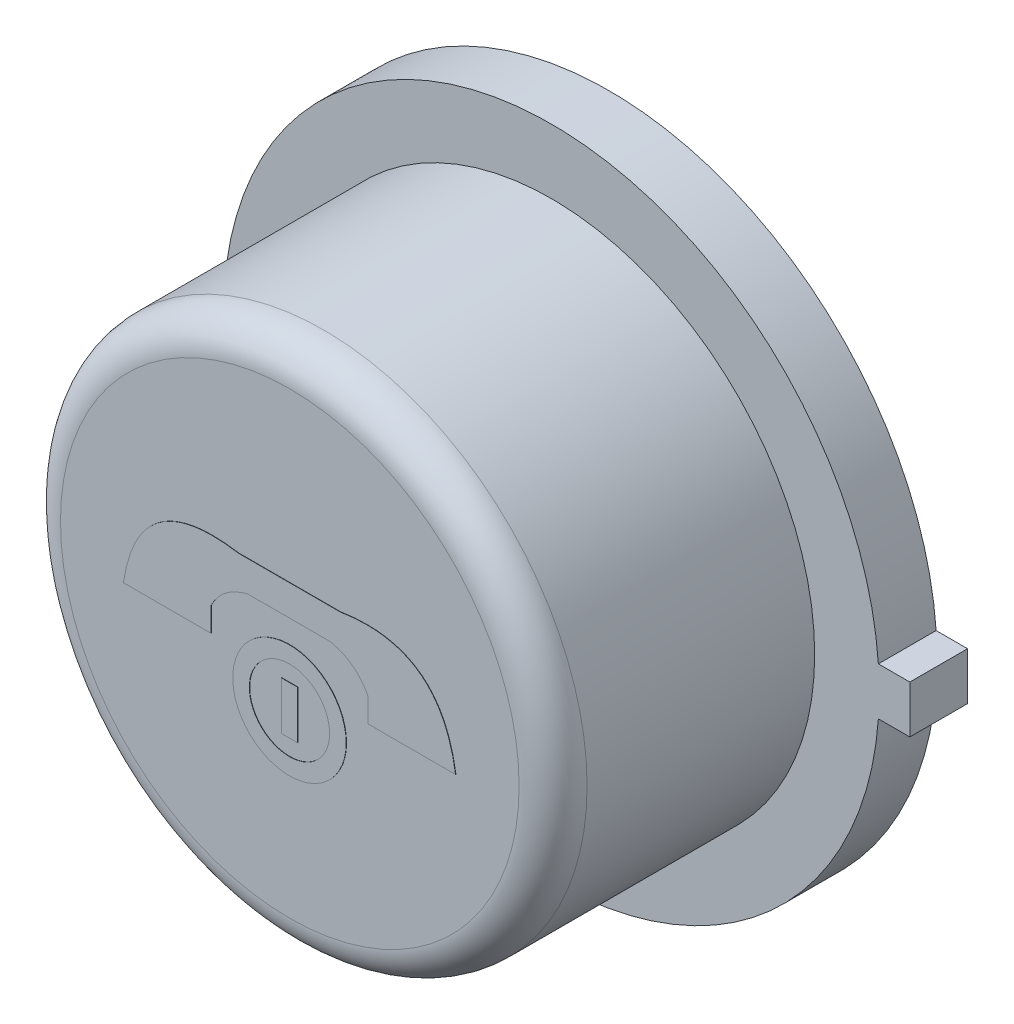
ISO-10303-21;
HEADER;
FILE_DESCRIPTION(('STEP AP214'),'2;1');
FILE_NAME('part.step','',(''),(''),'','','');
FILE_SCHEMA(('AUTOMOTIVE_DESIGN { 1 0 10303 214 1 1 1 1 }'));
ENDSEC;
DATA;
#1=APPLICATION_CONTEXT('core data for automotive mechanical design processes');
#2=APPLICATION_PROTOCOL_DEFINITION('international standard','automotive_design',2000,#1);
#3=PRODUCT_CONTEXT('',#1,'mechanical');
#4=PRODUCT('Part','Part','',(#3));
#5=PRODUCT_RELATED_PRODUCT_CATEGORY('part','',(#4));
#6=PRODUCT_DEFINITION_FORMATION('','',#4);
#7=PRODUCT_DEFINITION_CONTEXT('part definition',#1,'design');
#8=PRODUCT_DEFINITION('design','',#6,#7);
#9=PRODUCT_DEFINITION_SHAPE('','',#8);
#10=(LENGTH_UNIT() NAMED_UNIT(*) SI_UNIT(.MILLI.,.METRE.));
#11=(NAMED_UNIT(*) PLANE_ANGLE_UNIT() SI_UNIT($,.RADIAN.));
#12=(NAMED_UNIT(*) SI_UNIT($,.STERADIAN.) SOLID_ANGLE_UNIT());
#13=UNCERTAINTY_MEASURE_WITH_UNIT(LENGTH_MEASURE(1.E-05),#10,'distance_accuracy_value','');
#14=(GEOMETRIC_REPRESENTATION_CONTEXT(3) GLOBAL_UNCERTAINTY_ASSIGNED_CONTEXT((#13)) GLOBAL_UNIT_ASSIGNED_CONTEXT((#10,
#11,#12)) REPRESENTATION_CONTEXT('',''));
#15=CARTESIAN_POINT('',(0.,0.,0.));
#16=DIRECTION('',(0.,0.,1.));
#17=DIRECTION('',(1.,0.,0.));
#18=AXIS2_PLACEMENT_3D('',#15,#16,#17);
#19=CARTESIAN_POINT('',(0.,0.,2.3876));
#20=DIRECTION('',(0.,0.,1.));
#21=DIRECTION('',(1.,0.,0.));
#22=AXIS2_PLACEMENT_3D('',#19,#20,#21);
#23=PLANE('',#22);
#24=CARTESIAN_POINT('',(0.586204822214339,0.0210519107698976,2.3876));
#25=CARTESIAN_POINT('',(0.500696389227425,0.187631337955704,2.3876));
#26=CARTESIAN_POINT('',(0.309059488402211,0.231300095041167,2.3876));
#27=B_SPLINE_CURVE_WITH_KNOTS('',2,(#24,#25,#26),.UNSPECIFIED.,.F.,.F.,(3,3),(0.,1.),.UNSPECIFIED.);
#28=CARTESIAN_POINT('',(0.586204822214338,0.0210519107698981,2.3876));
#29=VERTEX_POINT('',#28);
#30=CARTESIAN_POINT('',(0.309059488402211,0.231300095041167,2.3876));
#31=VERTEX_POINT('',#30);
#32=EDGE_CURVE('E237',#29,#31,#27,.T.);
#33=ORIENTED_EDGE('',*,*,#32,.T.);
#34=DIRECTION('',(1.,0.,0.));
#35=VECTOR('',#34,1.);
#36=CARTESIAN_POINT('',(0.,0.231300095041167,2.3876));
#37=LINE('',#36,#35);
#38=CARTESIAN_POINT('',(-0.309059488402211,0.231300095041167,2.3876));
#39=VERTEX_POINT('',#38);
#40=EDGE_CURVE('E253',#39,#31,#37,.T.);
#41=ORIENTED_EDGE('',*,*,#40,.F.);
#42=CARTESIAN_POINT('',(-0.586204822214338,0.0210519107698975,2.3876));
#43=CARTESIAN_POINT('',(-0.500696389227425,0.187631337955704,2.3876));
#44=CARTESIAN_POINT('',(-0.309059488402211,0.231300095041167,2.3876));
#45=B_SPLINE_CURVE_WITH_KNOTS('',2,(#42,#43,#44),.UNSPECIFIED.,.F.,.F.,(3,3),(0.,1.),.UNSPECIFIED.);
#46=CARTESIAN_POINT('',(-0.586204822214338,0.0210519107698981,2.3876));
#47=VERTEX_POINT('',#46);
#48=EDGE_CURVE('E699',#47,#39,#45,.T.);
#49=ORIENTED_EDGE('',*,*,#48,.F.);
#50=DIRECTION('',(0.,1.,0.));
#51=VECTOR('',#50,1.);
#52=CARTESIAN_POINT('',(-0.586204822214338,-3.91332135623731,2.3876));
#53=LINE('',#52,#51);
#54=CARTESIAN_POINT('',(-0.586204822214338,-0.16052606655529,2.3876));
#55=VERTEX_POINT('',#54);
#56=EDGE_CURVE('E697',#55,#47,#53,.T.);
#57=ORIENTED_EDGE('',*,*,#56,.F.);
#58=DIRECTION('',(1.,0.,0.));
#59=VECTOR('',#58,1.);
#60=CARTESIAN_POINT('',(0.,-0.16052606655529,2.3876));
#61=LINE('',#60,#59);
#62=CARTESIAN_POINT('',(-1.24197144402187,-0.16052606655529,2.3876));
#63=VERTEX_POINT('',#62);
#64=EDGE_CURVE('E692',#63,#55,#61,.T.);
#65=ORIENTED_EDGE('',*,*,#64,.F.);
#66=CARTESIAN_POINT('',(-1.24197144402187,-0.16052606655529,2.3876));
#67=CARTESIAN_POINT('',(-1.13099050288792,0.580439960633998,2.3876));
#68=CARTESIAN_POINT('',(-0.37957161908372,0.460661750609824,2.3876));
#69=B_SPLINE_CURVE_WITH_KNOTS('',2,(#66,#67,#68),.UNSPECIFIED.,.F.,.F.,(3,3),(0.,1.),.UNSPECIFIED.);
#70=CARTESIAN_POINT('',(-0.37957161908372,0.460661750609825,2.3876));
#71=VERTEX_POINT('',#70);
#72=EDGE_CURVE('E687',#63,#71,#69,.T.);
#73=ORIENTED_EDGE('',*,*,#72,.T.);
#74=DIRECTION('',(1.,0.,0.));
#75=VECTOR('',#74,1.);
#76=CARTESIAN_POINT('',(0.,0.460661750609825,2.3876));
#77=LINE('',#76,#75);
#78=CARTESIAN_POINT('',(0.37957161908372,0.460661750609825,2.3876));
#79=VERTEX_POINT('',#78);
#80=EDGE_CURVE('E681',#71,#79,#77,.T.);
#81=ORIENTED_EDGE('',*,*,#80,.T.);
#82=CARTESIAN_POINT('',(1.24197144402187,-0.16052606655529,2.3876));
#83=CARTESIAN_POINT('',(1.13099050288792,0.580439960633998,2.3876));
#84=CARTESIAN_POINT('',(0.379571619083721,0.460661750609824,2.3876));
#85=B_SPLINE_CURVE_WITH_KNOTS('',2,(#82,#83,#84),.UNSPECIFIED.,.F.,.F.,(3,3),(0.,1.),.UNSPECIFIED.);
#86=CARTESIAN_POINT('',(1.24197144402187,-0.16052606655529,2.3876));
#87=VERTEX_POINT('',#86);
#88=EDGE_CURVE('E676',#87,#79,#85,.T.);
#89=ORIENTED_EDGE('',*,*,#88,.F.);
#90=DIRECTION('',(-1.,0.,0.));
#91=VECTOR('',#90,1.);
#92=CARTESIAN_POINT('',(0.,-0.16052606655529,2.3876));
#93=LINE('',#92,#91);
#94=CARTESIAN_POINT('',(0.586204822214338,-0.16052606655529,2.3876));
#95=VERTEX_POINT('',#94);
#96=EDGE_CURVE('E673',#87,#95,#93,.T.);
#97=ORIENTED_EDGE('',*,*,#96,.T.);
#98=DIRECTION('',(0.,1.,0.));
#99=VECTOR('',#98,1.);
#100=CARTESIAN_POINT('',(0.586204822214338,-3.91332135623731,2.3876));
#101=LINE('',#100,#99);
#102=EDGE_CURVE('E668',#95,#29,#101,.T.);
#103=ORIENTED_EDGE('',*,*,#102,.T.);
#104=EDGE_LOOP('',(#33,#41,#49,#57,#65,#73,#81,#89,#97,#103));
#105=FACE_BOUND('',#104,.T.);
#106=CARTESIAN_POINT('',(0.,0.,2.3876));
#107=DIRECTION('',(0.,0.,1.));
#108=DIRECTION('',(1.,0.,0.));
#109=AXIS2_PLACEMENT_3D('',#106,#107,#108);
#110=CIRCLE('',#109,1.7145);
#111=CARTESIAN_POINT('',(1.7145,0.,2.3876));
#112=VERTEX_POINT('',#111);
#113=EDGE_CURVE('E370',#112,#112,#110,.T.);
#114=ORIENTED_EDGE('',*,*,#113,.T.);
#115=EDGE_LOOP('',(#114));
#116=FACE_BOUND('',#115,.T.);
#117=CARTESIAN_POINT('',(0.,-0.366036864527016,2.3876));
#118=DIRECTION('',(0.,0.,1.));
#119=DIRECTION('',(1.,0.,0.));
#120=AXIS2_PLACEMENT_3D('',#117,#118,#119);
#121=CIRCLE('',#120,0.424306482423607);
#122=CARTESIAN_POINT('',(0.424306482423607,-0.366036864527016,2.3876));
#123=VERTEX_POINT('',#122);
#124=EDGE_CURVE('E373',#123,#123,#121,.T.);
#125=ORIENTED_EDGE('',*,*,#124,.F.);
#126=EDGE_LOOP('',(#125));
#127=FACE_BOUND('',#126,.T.);
#128=ADVANCED_FACE('F103',(#105,#116,#127),#23,.T.);
#129=CARTESIAN_POINT('',(-0.00322860507148085,-5.53029106093277,0.));
#130=DIRECTION('',(0.,0.,1.));
#131=DIRECTION('',(1.,0.,0.));
#132=AXIS2_PLACEMENT_3D('',#129,#130,#131);
#133=PLANE('',#132);
#134=DIRECTION('',(1.,0.,0.));
#135=VECTOR('',#134,1.);
#136=CARTESIAN_POINT('',(-0.0032286050714822,0.177799999999999,0.));
#137=LINE('',#136,#135);
#138=CARTESIAN_POINT('',(2.44464278985704,0.177799999999999,0.));
#139=VERTEX_POINT('',#138);
#140=CARTESIAN_POINT('',(2.6797,0.177799999999999,0.));
#141=VERTEX_POINT('',#140);
#142=EDGE_CURVE('E391',#139,#141,#137,.T.);
#143=ORIENTED_EDGE('',*,*,#142,.T.);
#144=DIRECTION('',(0.,-1.,0.));
#145=VECTOR('',#144,1.);
#146=CARTESIAN_POINT('',(2.6797,-5.53029106093277,0.));
#147=LINE('',#146,#145);
#148=CARTESIAN_POINT('',(2.6797,-0.1778,0.));
#149=VERTEX_POINT('',#148);
#150=EDGE_CURVE('E396',#141,#149,#147,.T.);
#151=ORIENTED_EDGE('',*,*,#150,.T.);
#152=DIRECTION('',(-1.,0.,0.));
#153=VECTOR('',#152,1.);
#154=CARTESIAN_POINT('',(-0.00322860507148085,-0.1778,0.));
#155=LINE('',#154,#153);
#156=CARTESIAN_POINT('',(2.44464278985704,-0.1778,0.));
#157=VERTEX_POINT('',#156);
#158=EDGE_CURVE('E410',#149,#157,#155,.T.);
#159=ORIENTED_EDGE('',*,*,#158,.T.);
#160=CARTESIAN_POINT('',(0.,0.,0.));
#161=DIRECTION('',(0.,0.,1.));
#162=DIRECTION('',(1.,0.,0.));
#163=AXIS2_PLACEMENT_3D('',#160,#161,#162);
#164=CIRCLE('',#163,2.4511);
#165=EDGE_CURVE('E407',#139,#157,#164,.T.);
#166=ORIENTED_EDGE('',*,*,#165,.F.);
#167=EDGE_LOOP('',(#143,#151,#159,#166));
#168=FACE_BOUND('',#167,.T.);
#169=CARTESIAN_POINT('',(0.,0.,0.));
#170=DIRECTION('',(0.,0.,1.));
#171=DIRECTION('',(1.,0.,0.));
#172=AXIS2_PLACEMENT_3D('',#169,#170,#171);
#173=CIRCLE('',#172,1.75756648099992);
#174=CARTESIAN_POINT('',(1.75756648099992,0.,0.));
#175=VERTEX_POINT('',#174);
#176=EDGE_CURVE('E422',#175,#175,#173,.F.);
#177=ORIENTED_EDGE('',*,*,#176,.F.);
#178=EDGE_LOOP('',(#177));
#179=FACE_BOUND('',#178,.T.);
#180=ADVANCED_FACE('F341',(#168,#179),#133,.F.);
#181=CARTESIAN_POINT('',(-0.00322860507148085,-5.53029106093277,0.4318));
#182=DIRECTION('',(0.,0.,1.));
#183=DIRECTION('',(1.,0.,0.));
#184=AXIS2_PLACEMENT_3D('',#181,#182,#183);
#185=PLANE('',#184);
#186=DIRECTION('',(1.,0.,0.));
#187=VECTOR('',#186,1.);
#188=CARTESIAN_POINT('',(-0.0032286050714822,0.177799999999999,0.4318));
#189=LINE('',#188,#187);
#190=CARTESIAN_POINT('',(2.44464278985704,0.177799999999999,0.4318));
#191=VERTEX_POINT('',#190);
#192=CARTESIAN_POINT('',(2.6797,0.177799999999999,0.4318));
#193=VERTEX_POINT('',#192);
#194=EDGE_CURVE('E392',#191,#193,#189,.T.);
#195=ORIENTED_EDGE('',*,*,#194,.F.);
#196=CARTESIAN_POINT('',(0.,0.,0.4318));
#197=DIRECTION('',(0.,0.,1.));
#198=DIRECTION('',(1.,0.,0.));
#199=AXIS2_PLACEMENT_3D('',#196,#197,#198);
#200=CIRCLE('',#199,2.4511);
#201=CARTESIAN_POINT('',(2.44464278985704,-0.1778,0.4318));
#202=VERTEX_POINT('',#201);
#203=EDGE_CURVE('E395',#191,#202,#200,.T.);
#204=ORIENTED_EDGE('',*,*,#203,.T.);
#205=DIRECTION('',(-1.,0.,0.));
#206=VECTOR('',#205,1.);
#207=CARTESIAN_POINT('',(-0.00322860507148085,-0.1778,0.4318));
#208=LINE('',#207,#206);
#209=CARTESIAN_POINT('',(2.6797,-0.1778,0.4318));
#210=VERTEX_POINT('',#209);
#211=EDGE_CURVE('E398',#210,#202,#208,.T.);
#212=ORIENTED_EDGE('',*,*,#211,.F.);
#213=DIRECTION('',(0.,-1.,0.));
#214=VECTOR('',#213,1.);
#215=CARTESIAN_POINT('',(2.6797,-5.53029106093277,0.4318));
#216=LINE('',#215,#214);
#217=EDGE_CURVE('E401',#193,#210,#216,.T.);
#218=ORIENTED_EDGE('',*,*,#217,.F.);
#219=EDGE_LOOP('',(#195,#204,#212,#218));
#220=FACE_BOUND('',#219,.T.);
#221=CARTESIAN_POINT('',(0.,0.,0.4318));
#222=DIRECTION('',(0.,0.,1.));
#223=DIRECTION('',(1.,0.,0.));
#224=AXIS2_PLACEMENT_3D('',#221,#222,#223);
#225=CIRCLE('',#224,1.9685);
#226=CARTESIAN_POINT('',(1.9685,0.,0.4318));
#227=VERTEX_POINT('',#226);
#228=EDGE_CURVE('E388',#227,#227,#225,.T.);
#229=ORIENTED_EDGE('',*,*,#228,.F.);
#230=EDGE_LOOP('',(#229));
#231=FACE_BOUND('',#230,.T.);
#232=ADVANCED_FACE('F337',(#220,#231),#185,.T.);
#233=CARTESIAN_POINT('',(-0.0032286050714822,0.177799999999999,0.4318));
#234=DIRECTION('',(0.,1.,0.));
#235=DIRECTION('',(-1.,0.,0.));
#236=AXIS2_PLACEMENT_3D('',#233,#234,#235);
#237=PLANE('',#236);
#238=ORIENTED_EDGE('',*,*,#142,.F.);
#239=DIRECTION('',(0.,0.,-1.));
#240=VECTOR('',#239,1.);
#241=CARTESIAN_POINT('',(2.44464278985704,0.177799999999999,0.4318));
#242=LINE('',#241,#240);
#243=EDGE_CURVE('E420',#191,#139,#242,.T.);
#244=ORIENTED_EDGE('',*,*,#243,.F.);
#245=ORIENTED_EDGE('',*,*,#194,.T.);
#246=DIRECTION('',(0.,0.,-1.));
#247=VECTOR('',#246,1.);
#248=CARTESIAN_POINT('',(2.6797,0.177799999999999,0.4318));
#249=LINE('',#248,#247);
#250=EDGE_CURVE('E404',#193,#141,#249,.T.);
#251=ORIENTED_EDGE('',*,*,#250,.T.);
#252=EDGE_LOOP('',(#238,#244,#245,#251));
#253=FACE_BOUND('',#252,.T.);
#254=ADVANCED_FACE('F340',(#253),#237,.T.);
#255=CARTESIAN_POINT('',(0.,0.,0.4318));
#256=DIRECTION('',(0.,0.,-1.));
#257=DIRECTION('',(-1.,0.,0.));
#258=AXIS2_PLACEMENT_3D('',#255,#256,#257);
#259=CYLINDRICAL_SURFACE('',#258,2.4511);
#260=ORIENTED_EDGE('',*,*,#165,.T.);
#261=DIRECTION('',(0.,0.,-1.));
#262=VECTOR('',#261,1.);
#263=CARTESIAN_POINT('',(2.44464278985704,-0.1778,0.4318));
#264=LINE('',#263,#262);
#265=EDGE_CURVE('E418',#202,#157,#264,.T.);
#266=ORIENTED_EDGE('',*,*,#265,.F.);
#267=ORIENTED_EDGE('',*,*,#203,.F.);
#268=ORIENTED_EDGE('',*,*,#243,.T.);
#269=EDGE_LOOP('',(#260,#266,#267,#268));
#270=FACE_BOUND('',#269,.T.);
#271=ADVANCED_FACE('F352',(#270),#259,.T.);
#272=CARTESIAN_POINT('',(-0.00322860507148085,-0.1778,0.4318));
#273=DIRECTION('',(0.,-1.,0.));
#274=DIRECTION('',(0.,0.,-1.));
#275=AXIS2_PLACEMENT_3D('',#272,#273,#274);
#276=PLANE('',#275);
#277=ORIENTED_EDGE('',*,*,#158,.F.);
#278=DIRECTION('',(0.,0.,-1.));
#279=VECTOR('',#278,1.);
#280=CARTESIAN_POINT('',(2.6797,-0.1778,0.4318));
#281=LINE('',#280,#279);
#282=EDGE_CURVE('E416',#210,#149,#281,.T.);
#283=ORIENTED_EDGE('',*,*,#282,.F.);
#284=ORIENTED_EDGE('',*,*,#211,.T.);
#285=ORIENTED_EDGE('',*,*,#265,.T.);
#286=EDGE_LOOP('',(#277,#283,#284,#285));
#287=FACE_BOUND('',#286,.T.);
#288=ADVANCED_FACE('F348',(#287),#276,.T.);
#289=CARTESIAN_POINT('',(2.6797,-5.53029106093277,0.4318));
#290=DIRECTION('',(1.,0.,0.));
#291=DIRECTION('',(0.,0.,-1.));
#292=AXIS2_PLACEMENT_3D('',#289,#290,#291);
#293=PLANE('',#292);
#294=ORIENTED_EDGE('',*,*,#150,.F.);
#295=ORIENTED_EDGE('',*,*,#250,.F.);
#296=ORIENTED_EDGE('',*,*,#217,.T.);
#297=ORIENTED_EDGE('',*,*,#282,.T.);
#298=EDGE_LOOP('',(#294,#295,#296,#297));
#299=FACE_BOUND('',#298,.T.);
#300=ADVANCED_FACE('F335',(#299),#293,.T.);
#301=CARTESIAN_POINT('',(0.,0.,2.3876));
#302=DIRECTION('',(0.,0.,-1.));
#303=DIRECTION('',(-1.,0.,0.));
#304=AXIS2_PLACEMENT_3D('',#301,#302,#303);
#305=CYLINDRICAL_SURFACE('',#304,1.9685);
#306=CARTESIAN_POINT('',(0.,0.,2.1336));
#307=DIRECTION('',(0.,0.,1.));
#308=DIRECTION('',(1.,0.,0.));
#309=AXIS2_PLACEMENT_3D('',#306,#307,#308);
#310=CIRCLE('',#309,1.9685);
#311=CARTESIAN_POINT('',(1.9685,0.,2.1336));
#312=VERTEX_POINT('',#311);
#313=EDGE_CURVE('E111',#312,#312,#310,.F.);
#314=ORIENTED_EDGE('',*,*,#313,.T.);
#315=EDGE_LOOP('',(#314));
#316=FACE_BOUND('',#315,.T.);
#317=ORIENTED_EDGE('',*,*,#228,.T.);
#318=EDGE_LOOP('',(#317));
#319=FACE_BOUND('',#318,.T.);
#320=ADVANCED_FACE('F328',(#316,#319),#305,.T.);
#321=CARTESIAN_POINT('',(0.,0.,-0.00254));
#322=DIRECTION('',(0.,0.,1.));
#323=DIRECTION('',(1.,0.,0.));
#324=AXIS2_PLACEMENT_3D('',#321,#322,#323);
#325=CYLINDRICAL_SURFACE('',#324,1.75756648099992);
#326=CARTESIAN_POINT('',(0.,0.,-0.00254));
#327=DIRECTION('',(0.,0.,-1.));
#328=DIRECTION('',(-1.,0.,0.));
#329=AXIS2_PLACEMENT_3D('',#326,#327,#328);
#330=CIRCLE('',#329,1.75756648099992);
#331=CARTESIAN_POINT('',(-1.75756648099992,0.,-0.00254));
#332=VERTEX_POINT('',#331);
#333=EDGE_CURVE('E385',#332,#332,#330,.T.);
#334=ORIENTED_EDGE('',*,*,#333,.F.);
#335=EDGE_LOOP('',(#334));
#336=FACE_BOUND('',#335,.T.);
#337=ORIENTED_EDGE('',*,*,#176,.T.);
#338=EDGE_LOOP('',(#337));
#339=FACE_BOUND('',#338,.T.);
#340=ADVANCED_FACE('F324',(#336,#339),#325,.T.);
#341=CARTESIAN_POINT('',(0.,0.,-0.00254));
#342=DIRECTION('',(0.,0.,-1.));
#343=DIRECTION('',(-1.,0.,0.));
#344=AXIS2_PLACEMENT_3D('',#341,#342,#343);
#345=PLANE('',#344);
#346=ORIENTED_EDGE('',*,*,#333,.T.);
#347=EDGE_LOOP('',(#346));
#348=FACE_BOUND('',#347,.T.);
#349=ADVANCED_FACE('F321',(#348),#345,.T.);
#350=CARTESIAN_POINT('',(0.,0.,2.1336));
#351=DIRECTION('',(0.,0.,1.));
#352=DIRECTION('',(1.,0.,0.));
#353=AXIS2_PLACEMENT_3D('',#350,#351,#352);
#354=TOROIDAL_SURFACE('',#353,1.7145,0.254);
#355=ORIENTED_EDGE('',*,*,#313,.F.);
#356=EDGE_LOOP('',(#355));
#357=FACE_BOUND('',#356,.T.);
#358=ORIENTED_EDGE('',*,*,#113,.F.);
#359=EDGE_LOOP('',(#358));
#360=FACE_BOUND('',#359,.T.);
#361=ADVANCED_FACE('F105',(#357,#360),#354,.T.);
#362=CARTESIAN_POINT('',(0.,-0.366036864527016,2.39014));
#363=DIRECTION('',(0.,0.,-1.));
#364=DIRECTION('',(-1.,0.,0.));
#365=AXIS2_PLACEMENT_3D('',#362,#363,#364);
#366=CYLINDRICAL_SURFACE('',#365,0.300017147953975);
#367=CARTESIAN_POINT('',(0.,-0.366036864527016,2.39014));
#368=DIRECTION('',(0.,0.,1.));
#369=DIRECTION('',(1.,0.,0.));
#370=AXIS2_PLACEMENT_3D('',#367,#368,#369);
#371=CIRCLE('',#370,0.300017147953975);
#372=CARTESIAN_POINT('',(0.300017147953975,-0.366036864527016,2.39014));
#373=VERTEX_POINT('',#372);
#374=EDGE_CURVE('E375',#373,#373,#371,.T.);
#375=ORIENTED_EDGE('',*,*,#374,.T.);
#376=EDGE_LOOP('',(#375));
#377=FACE_BOUND('',#376,.T.);
#378=CARTESIAN_POINT('',(0.,-0.366036864527016,2.3876));
#379=DIRECTION('',(0.,0.,1.));
#380=DIRECTION('',(1.,0.,0.));
#381=AXIS2_PLACEMENT_3D('',#378,#379,#380);
#382=CIRCLE('',#381,0.300017147953975);
#383=CARTESIAN_POINT('',(0.300017147953975,-0.366036864527016,2.3876));
#384=VERTEX_POINT('',#383);
#385=EDGE_CURVE('E12',#384,#384,#382,.F.);
#386=ORIENTED_EDGE('',*,*,#385,.T.);
#387=EDGE_LOOP('',(#386));
#388=FACE_BOUND('',#387,.T.);
#389=ADVANCED_FACE('F316',(#377,#388),#366,.F.);
#390=CARTESIAN_POINT('',(0.,-0.366036864527016,2.39014));
#391=DIRECTION('',(0.,0.,-1.));
#392=DIRECTION('',(-1.,0.,0.));
#393=AXIS2_PLACEMENT_3D('',#390,#391,#392);
#394=CYLINDRICAL_SURFACE('',#393,0.424306482423607);
#395=CARTESIAN_POINT('',(0.,-0.366036864527016,2.39014));
#396=DIRECTION('',(0.,0.,1.));
#397=DIRECTION('',(1.,0.,0.));
#398=AXIS2_PLACEMENT_3D('',#395,#396,#397);
#399=CIRCLE('',#398,0.424306482423607);
#400=CARTESIAN_POINT('',(0.424306482423607,-0.366036864527016,2.39014));
#401=VERTEX_POINT('',#400);
#402=EDGE_CURVE('E379',#401,#401,#399,.T.);
#403=ORIENTED_EDGE('',*,*,#402,.F.);
#404=EDGE_LOOP('',(#403));
#405=FACE_BOUND('',#404,.T.);
#406=ORIENTED_EDGE('',*,*,#124,.T.);
#407=EDGE_LOOP('',(#406));
#408=FACE_BOUND('',#407,.T.);
#409=ADVANCED_FACE('F312',(#405,#408),#394,.T.);
#410=CARTESIAN_POINT('',(0.,-3.91332135623731,2.39014));
#411=DIRECTION('',(0.,0.,1.));
#412=DIRECTION('',(1.,0.,0.));
#413=AXIS2_PLACEMENT_3D('',#410,#411,#412);
#414=PLANE('',#413);
#415=ORIENTED_EDGE('',*,*,#374,.F.);
#416=EDGE_LOOP('',(#415));
#417=FACE_BOUND('',#416,.T.);
#418=ORIENTED_EDGE('',*,*,#402,.T.);
#419=EDGE_LOOP('',(#418));
#420=FACE_BOUND('',#419,.T.);
#421=ADVANCED_FACE('F309',(#417,#420),#414,.T.);
#422=DIRECTION('',(0.,-1.,0.));
#423=VECTOR('',#422,1.);
#424=CARTESIAN_POINT('',(0.0606948542233259,-3.91332135623731,2.3876));
#425=LINE('',#424,#423);
#426=CARTESIAN_POINT('',(0.0606948542233259,-0.185960308804976,2.3876));
#427=VERTEX_POINT('',#426);
#428=CARTESIAN_POINT('',(0.0606948542233259,-0.546113420249056,2.3876));
#429=VERTEX_POINT('',#428);
#430=EDGE_CURVE('E242',#427,#429,#425,.T.);
#431=ORIENTED_EDGE('',*,*,#430,.T.);
#432=DIRECTION('',(1.,0.,0.));
#433=VECTOR('',#432,1.);
#434=CARTESIAN_POINT('',(0.,-0.546113420249056,2.3876));
#435=LINE('',#434,#433);
#436=CARTESIAN_POINT('',(-0.0606948542233259,-0.546113420249056,2.3876));
#437=VERTEX_POINT('',#436);
#438=EDGE_CURVE('E728',#437,#429,#435,.T.);
#439=ORIENTED_EDGE('',*,*,#438,.F.);
#440=DIRECTION('',(0.,-1.,0.));
#441=VECTOR('',#440,1.);
#442=CARTESIAN_POINT('',(-0.0606948542233244,-3.91332135623731,2.3876));
#443=LINE('',#442,#441);
#444=CARTESIAN_POINT('',(-0.0606948542233261,-0.185960308804976,2.3876));
#445=VERTEX_POINT('',#444);
#446=EDGE_CURVE('E741',#445,#437,#443,.T.);
#447=ORIENTED_EDGE('',*,*,#446,.F.);
#448=DIRECTION('',(1.,0.,0.));
#449=VECTOR('',#448,1.);
#450=CARTESIAN_POINT('',(0.,-0.185960308804976,2.3876));
#451=LINE('',#450,#449);
#452=EDGE_CURVE('E738',#445,#427,#451,.T.);
#453=ORIENTED_EDGE('',*,*,#452,.T.);
#454=EDGE_LOOP('',(#431,#439,#447,#453));
#455=FACE_BOUND('',#454,.T.);
#456=ORIENTED_EDGE('',*,*,#385,.F.);
#457=EDGE_LOOP('',(#456));
#458=FACE_BOUND('',#457,.T.);
#459=ADVANCED_FACE('F307',(#455,#458),#23,.T.);
#460=CARTESIAN_POINT('',(0.0606948542233259,-3.91332135623731,2.39014));
#461=DIRECTION('',(1.,0.,0.));
#462=DIRECTION('',(0.,1.,0.));
#463=AXIS2_PLACEMENT_3D('',#460,#461,#462);
#464=PLANE('',#463);
#465=ORIENTED_EDGE('',*,*,#430,.F.);
#466=DIRECTION('',(0.,0.,-1.));
#467=VECTOR('',#466,1.);
#468=CARTESIAN_POINT('',(0.0606948542233259,-0.185960308804976,2.39014));
#469=LINE('',#468,#467);
#470=CARTESIAN_POINT('',(0.0606948542233259,-0.185960308804976,2.39014));
#471=VERTEX_POINT('',#470);
#472=EDGE_CURVE('E376',#471,#427,#469,.T.);
#473=ORIENTED_EDGE('',*,*,#472,.F.);
#474=DIRECTION('',(0.,-1.,0.));
#475=VECTOR('',#474,1.);
#476=CARTESIAN_POINT('',(0.0606948542233259,-3.91332135623731,2.39014));
#477=LINE('',#476,#475);
#478=CARTESIAN_POINT('',(0.0606948542233259,-0.546113420249056,2.39014));
#479=VERTEX_POINT('',#478);
#480=EDGE_CURVE('E724',#471,#479,#477,.T.);
#481=ORIENTED_EDGE('',*,*,#480,.T.);
#482=DIRECTION('',(0.,0.,-1.));
#483=VECTOR('',#482,1.);
#484=CARTESIAN_POINT('',(0.0606948542233259,-0.546113420249056,2.39014));
#485=LINE('',#484,#483);
#486=EDGE_CURVE('E735',#479,#429,#485,.T.);
#487=ORIENTED_EDGE('',*,*,#486,.T.);
#488=EDGE_LOOP('',(#465,#473,#481,#487));
#489=FACE_BOUND('',#488,.T.);
#490=ADVANCED_FACE('F303',(#489),#464,.T.);
#491=CARTESIAN_POINT('',(0.,-0.185960308804976,2.39014));
#492=DIRECTION('',(0.,1.,0.));
#493=DIRECTION('',(-1.,0.,0.));
#494=AXIS2_PLACEMENT_3D('',#491,#492,#493);
#495=PLANE('',#494);
#496=ORIENTED_EDGE('',*,*,#452,.F.);
#497=DIRECTION('',(0.,0.,-1.));
#498=VECTOR('',#497,1.);
#499=CARTESIAN_POINT('',(-0.0606948542233261,-0.185960308804976,2.39014));
#500=LINE('',#499,#498);
#501=CARTESIAN_POINT('',(-0.0606948542233261,-0.185960308804976,2.39014));
#502=VERTEX_POINT('',#501);
#503=EDGE_CURVE('E381',#502,#445,#500,.T.);
#504=ORIENTED_EDGE('',*,*,#503,.F.);
#505=DIRECTION('',(1.,0.,0.));
#506=VECTOR('',#505,1.);
#507=CARTESIAN_POINT('',(0.,-0.185960308804976,2.39014));
#508=LINE('',#507,#506);
#509=EDGE_CURVE('E727',#502,#471,#508,.T.);
#510=ORIENTED_EDGE('',*,*,#509,.T.);
#511=ORIENTED_EDGE('',*,*,#472,.T.);
#512=EDGE_LOOP('',(#496,#504,#510,#511));
#513=FACE_BOUND('',#512,.T.);
#514=ADVANCED_FACE('F299',(#513),#495,.T.);
#515=CARTESIAN_POINT('',(-0.0606948542233244,-3.91332135623731,2.39014));
#516=DIRECTION('',(1.,0.,0.));
#517=DIRECTION('',(0.,1.,0.));
#518=AXIS2_PLACEMENT_3D('',#515,#516,#517);
#519=PLANE('',#518);
#520=ORIENTED_EDGE('',*,*,#446,.T.);
#521=DIRECTION('',(0.,0.,-1.));
#522=VECTOR('',#521,1.);
#523=CARTESIAN_POINT('',(-0.0606948542233259,-0.546113420249056,2.39014));
#524=LINE('',#523,#522);
#525=CARTESIAN_POINT('',(-0.0606948542233259,-0.546113420249056,2.39014));
#526=VERTEX_POINT('',#525);
#527=EDGE_CURVE('E126',#526,#437,#524,.T.);
#528=ORIENTED_EDGE('',*,*,#527,.F.);
#529=DIRECTION('',(0.,-1.,0.));
#530=VECTOR('',#529,1.);
#531=CARTESIAN_POINT('',(-0.0606948542233244,-3.91332135623731,2.39014));
#532=LINE('',#531,#530);
#533=EDGE_CURVE('E731',#502,#526,#532,.T.);
#534=ORIENTED_EDGE('',*,*,#533,.F.);
#535=ORIENTED_EDGE('',*,*,#503,.T.);
#536=EDGE_LOOP('',(#520,#528,#534,#535));
#537=FACE_BOUND('',#536,.T.);
#538=ADVANCED_FACE('F296',(#537),#519,.F.);
#539=CARTESIAN_POINT('',(0.,-0.546113420249056,2.39014));
#540=DIRECTION('',(0.,1.,0.));
#541=DIRECTION('',(-1.,0.,0.));
#542=AXIS2_PLACEMENT_3D('',#539,#540,#541);
#543=PLANE('',#542);
#544=ORIENTED_EDGE('',*,*,#438,.T.);
#545=ORIENTED_EDGE('',*,*,#486,.F.);
#546=DIRECTION('',(1.,0.,0.));
#547=VECTOR('',#546,1.);
#548=CARTESIAN_POINT('',(0.,-0.546113420249056,2.39014));
#549=LINE('',#548,#547);
#550=EDGE_CURVE('E733',#526,#479,#549,.T.);
#551=ORIENTED_EDGE('',*,*,#550,.F.);
#552=ORIENTED_EDGE('',*,*,#527,.T.);
#553=EDGE_LOOP('',(#544,#545,#551,#552));
#554=FACE_BOUND('',#553,.T.);
#555=ADVANCED_FACE('F292',(#554),#543,.F.);
#556=CARTESIAN_POINT('',(0.,-3.91332135623731,2.39014));
#557=DIRECTION('',(0.,0.,1.));
#558=DIRECTION('',(1.,0.,0.));
#559=AXIS2_PLACEMENT_3D('',#556,#557,#558);
#560=PLANE('',#559);
#561=ORIENTED_EDGE('',*,*,#480,.F.);
#562=ORIENTED_EDGE('',*,*,#509,.F.);
#563=ORIENTED_EDGE('',*,*,#533,.T.);
#564=ORIENTED_EDGE('',*,*,#550,.T.);
#565=EDGE_LOOP('',(#561,#562,#563,#564));
#566=FACE_BOUND('',#565,.T.);
#567=ADVANCED_FACE('F289',(#566),#560,.T.);
#568=CARTESIAN_POINT('',(0.586204822214339,0.0210519107698976,2.39014));
#569=CARTESIAN_POINT('',(0.500696389227425,0.187631337955704,2.39014));
#570=CARTESIAN_POINT('',(0.309059488402211,0.231300095041167,2.39014));
#571=B_SPLINE_CURVE_WITH_KNOTS('',2,(#568,#569,#570),.UNSPECIFIED.,.F.,.F.,(3,3),(0.,1.),.UNSPECIFIED.);
#572=DIRECTION('',(0.,0.,-1.));
#573=VECTOR('',#572,1.);
#574=SURFACE_OF_LINEAR_EXTRUSION('',#571,#573);
#575=ORIENTED_EDGE('',*,*,#32,.F.);
#576=DIRECTION('',(0.,0.,-1.));
#577=VECTOR('',#576,1.);
#578=CARTESIAN_POINT('',(0.586204822214338,0.0210519107698981,2.39014));
#579=LINE('',#578,#577);
#580=CARTESIAN_POINT('',(0.586204822214338,0.0210519107698981,2.39014));
#581=VERTEX_POINT('',#580);
#582=EDGE_CURVE('E232',#581,#29,#579,.T.);
#583=ORIENTED_EDGE('',*,*,#582,.F.);
#584=CARTESIAN_POINT('',(0.309059488402211,0.231300095041167,2.39014));
#585=VERTEX_POINT('',#584);
#586=EDGE_CURVE('E235',#581,#585,#571,.T.);
#587=ORIENTED_EDGE('',*,*,#586,.T.);
#588=DIRECTION('',(0.,0.,-1.));
#589=VECTOR('',#588,1.);
#590=CARTESIAN_POINT('',(0.309059488402211,0.231300095041167,2.39014));
#591=LINE('',#590,#589);
#592=EDGE_CURVE('E664',#585,#31,#591,.T.);
#593=ORIENTED_EDGE('',*,*,#592,.T.);
#594=EDGE_LOOP('',(#575,#583,#587,#593));
#595=FACE_BOUND('',#594,.T.);
#596=ADVANCED_FACE('F234',(#595),#574,.T.);
#597=CARTESIAN_POINT('',(0.586204822214338,-3.91332135623731,2.39014));
#598=DIRECTION('',(-1.,0.,0.));
#599=DIRECTION('',(0.,0.,1.));
#600=AXIS2_PLACEMENT_3D('',#597,#598,#599);
#601=PLANE('',#600);
#602=ORIENTED_EDGE('',*,*,#102,.F.);
#603=DIRECTION('',(0.,0.,-1.));
#604=VECTOR('',#603,1.);
#605=CARTESIAN_POINT('',(0.586204822214338,-0.16052606655529,2.39014));
#606=LINE('',#605,#604);
#607=CARTESIAN_POINT('',(0.586204822214338,-0.16052606655529,2.39014));
#608=VERTEX_POINT('',#607);
#609=EDGE_CURVE('E243',#608,#95,#606,.T.);
#610=ORIENTED_EDGE('',*,*,#609,.F.);
#611=DIRECTION('',(0.,1.,0.));
#612=VECTOR('',#611,1.);
#613=CARTESIAN_POINT('',(0.586204822214338,-3.91332135623731,2.39014));
#614=LINE('',#613,#612);
#615=EDGE_CURVE('E249',#608,#581,#614,.T.);
#616=ORIENTED_EDGE('',*,*,#615,.T.);
#617=ORIENTED_EDGE('',*,*,#582,.T.);
#618=EDGE_LOOP('',(#602,#610,#616,#617));
#619=FACE_BOUND('',#618,.T.);
#620=ADVANCED_FACE('F255',(#619),#601,.T.);
#621=CARTESIAN_POINT('',(0.,-0.16052606655529,2.39014));
#622=DIRECTION('',(0.,-1.,0.));
#623=DIRECTION('',(0.,0.,-1.));
#624=AXIS2_PLACEMENT_3D('',#621,#622,#623);
#625=PLANE('',#624);
#626=ORIENTED_EDGE('',*,*,#96,.F.);
#627=DIRECTION('',(0.,0.,-1.));
#628=VECTOR('',#627,1.);
#629=CARTESIAN_POINT('',(1.24197144402187,-0.16052606655529,2.39014));
#630=LINE('',#629,#628);
#631=CARTESIAN_POINT('',(1.24197144402187,-0.16052606655529,2.39014));
#632=VERTEX_POINT('',#631);
#633=EDGE_CURVE('E721',#632,#87,#630,.T.);
#634=ORIENTED_EDGE('',*,*,#633,.F.);
#635=DIRECTION('',(-1.,0.,0.));
#636=VECTOR('',#635,1.);
#637=CARTESIAN_POINT('',(0.,-0.16052606655529,2.39014));
#638=LINE('',#637,#636);
#639=EDGE_CURVE('E256',#632,#608,#638,.T.);
#640=ORIENTED_EDGE('',*,*,#639,.T.);
#641=ORIENTED_EDGE('',*,*,#609,.T.);
#642=EDGE_LOOP('',(#626,#634,#640,#641));
#643=FACE_BOUND('',#642,.T.);
#644=ADVANCED_FACE('F279',(#643),#625,.T.);
#645=CARTESIAN_POINT('',(1.24197144402187,-0.16052606655529,2.39014));
#646=CARTESIAN_POINT('',(1.13099050288792,0.580439960633998,2.39014));
#647=CARTESIAN_POINT('',(0.379571619083721,0.460661750609824,2.39014));
#648=B_SPLINE_CURVE_WITH_KNOTS('',2,(#645,#646,#647),.UNSPECIFIED.,.F.,.F.,(3,3),(0.,1.),.UNSPECIFIED.);
#649=DIRECTION('',(0.,0.,-1.));
#650=VECTOR('',#649,1.);
#651=SURFACE_OF_LINEAR_EXTRUSION('',#648,#650);
#652=ORIENTED_EDGE('',*,*,#88,.T.);
#653=DIRECTION('',(0.,0.,-1.));
#654=VECTOR('',#653,1.);
#655=CARTESIAN_POINT('',(0.37957161908372,0.460661750609825,2.39014));
#656=LINE('',#655,#654);
#657=CARTESIAN_POINT('',(0.37957161908372,0.460661750609825,2.39014));
#658=VERTEX_POINT('',#657);
#659=EDGE_CURVE('E719',#658,#79,#656,.T.);
#660=ORIENTED_EDGE('',*,*,#659,.F.);
#661=EDGE_CURVE('E258',#632,#658,#648,.T.);
#662=ORIENTED_EDGE('',*,*,#661,.F.);
#663=ORIENTED_EDGE('',*,*,#633,.T.);
#664=EDGE_LOOP('',(#652,#660,#662,#663));
#665=FACE_BOUND('',#664,.T.);
#666=ADVANCED_FACE('F274',(#665),#651,.F.);
#667=CARTESIAN_POINT('',(0.,0.460661750609825,2.39014));
#668=DIRECTION('',(0.,1.,0.));
#669=DIRECTION('',(0.,0.,1.));
#670=AXIS2_PLACEMENT_3D('',#667,#668,#669);
#671=PLANE('',#670);
#672=ORIENTED_EDGE('',*,*,#80,.F.);
#673=DIRECTION('',(0.,0.,-1.));
#674=VECTOR('',#673,1.);
#675=CARTESIAN_POINT('',(-0.37957161908372,0.460661750609825,2.39014));
#676=LINE('',#675,#674);
#677=CARTESIAN_POINT('',(-0.37957161908372,0.460661750609825,2.39014));
#678=VERTEX_POINT('',#677);
#679=EDGE_CURVE('E717',#678,#71,#676,.T.);
#680=ORIENTED_EDGE('',*,*,#679,.F.);
#681=DIRECTION('',(1.,0.,0.));
#682=VECTOR('',#681,1.);
#683=CARTESIAN_POINT('',(0.,0.460661750609825,2.39014));
#684=LINE('',#683,#682);
#685=EDGE_CURVE('E268',#678,#658,#684,.T.);
#686=ORIENTED_EDGE('',*,*,#685,.T.);
#687=ORIENTED_EDGE('',*,*,#659,.T.);
#688=EDGE_LOOP('',(#672,#680,#686,#687));
#689=FACE_BOUND('',#688,.T.);
#690=ADVANCED_FACE('F278',(#689),#671,.T.);
#691=CARTESIAN_POINT('',(-1.24197144402187,-0.16052606655529,2.39014));
#692=CARTESIAN_POINT('',(-1.13099050288792,0.580439960633998,2.39014));
#693=CARTESIAN_POINT('',(-0.37957161908372,0.460661750609824,2.39014));
#694=B_SPLINE_CURVE_WITH_KNOTS('',2,(#691,#692,#693),.UNSPECIFIED.,.F.,.F.,(3,3),(0.,1.),.UNSPECIFIED.);
#695=DIRECTION('',(0.,0.,-1.));
#696=VECTOR('',#695,1.);
#697=SURFACE_OF_LINEAR_EXTRUSION('',#694,#696);
#698=ORIENTED_EDGE('',*,*,#72,.F.);
#699=DIRECTION('',(0.,0.,-1.));
#700=VECTOR('',#699,1.);
#701=CARTESIAN_POINT('',(-1.24197144402187,-0.16052606655529,2.39014));
#702=LINE('',#701,#700);
#703=CARTESIAN_POINT('',(-1.24197144402187,-0.16052606655529,2.39014));
#704=VERTEX_POINT('',#703);
#705=EDGE_CURVE('E715',#704,#63,#702,.T.);
#706=ORIENTED_EDGE('',*,*,#705,.F.);
#707=EDGE_CURVE('E766',#704,#678,#694,.T.);
#708=ORIENTED_EDGE('',*,*,#707,.T.);
#709=ORIENTED_EDGE('',*,*,#679,.T.);
#710=EDGE_LOOP('',(#698,#706,#708,#709));
#711=FACE_BOUND('',#710,.T.);
#712=ADVANCED_FACE('F495',(#711),#697,.T.);
#713=CARTESIAN_POINT('',(0.,-0.16052606655529,2.39014));
#714=DIRECTION('',(0.,1.,0.));
#715=DIRECTION('',(0.,0.,1.));
#716=AXIS2_PLACEMENT_3D('',#713,#714,#715);
#717=PLANE('',#716);
#718=ORIENTED_EDGE('',*,*,#64,.T.);
#719=DIRECTION('',(0.,0.,-1.));
#720=VECTOR('',#719,1.);
#721=CARTESIAN_POINT('',(-0.586204822214338,-0.16052606655529,2.39014));
#722=LINE('',#721,#720);
#723=CARTESIAN_POINT('',(-0.586204822214338,-0.16052606655529,2.39014));
#724=VERTEX_POINT('',#723);
#725=EDGE_CURVE('E712',#724,#55,#722,.T.);
#726=ORIENTED_EDGE('',*,*,#725,.F.);
#727=DIRECTION('',(1.,0.,0.));
#728=VECTOR('',#727,1.);
#729=CARTESIAN_POINT('',(0.,-0.16052606655529,2.39014));
#730=LINE('',#729,#728);
#731=EDGE_CURVE('E769',#704,#724,#730,.T.);
#732=ORIENTED_EDGE('',*,*,#731,.F.);
#733=ORIENTED_EDGE('',*,*,#705,.T.);
#734=EDGE_LOOP('',(#718,#726,#732,#733));
#735=FACE_BOUND('',#734,.T.);
#736=ADVANCED_FACE('F502',(#735),#717,.F.);
#737=CARTESIAN_POINT('',(-0.586204822214338,-3.91332135623731,2.39014));
#738=DIRECTION('',(-1.,0.,0.));
#739=DIRECTION('',(0.,0.,1.));
#740=AXIS2_PLACEMENT_3D('',#737,#738,#739);
#741=PLANE('',#740);
#742=ORIENTED_EDGE('',*,*,#56,.T.);
#743=DIRECTION('',(0.,0.,-1.));
#744=VECTOR('',#743,1.);
#745=CARTESIAN_POINT('',(-0.586204822214338,0.0210519107698981,2.39014));
#746=LINE('',#745,#744);
#747=CARTESIAN_POINT('',(-0.586204822214338,0.0210519107698981,2.39014));
#748=VERTEX_POINT('',#747);
#749=EDGE_CURVE('E709',#748,#47,#746,.T.);
#750=ORIENTED_EDGE('',*,*,#749,.F.);
#751=DIRECTION('',(0.,1.,0.));
#752=VECTOR('',#751,1.);
#753=CARTESIAN_POINT('',(-0.586204822214338,-3.91332135623731,2.39014));
#754=LINE('',#753,#752);
#755=EDGE_CURVE('E658',#724,#748,#754,.T.);
#756=ORIENTED_EDGE('',*,*,#755,.F.);
#757=ORIENTED_EDGE('',*,*,#725,.T.);
#758=EDGE_LOOP('',(#742,#750,#756,#757));
#759=FACE_BOUND('',#758,.T.);
#760=ADVANCED_FACE('F509',(#759),#741,.F.);
#761=CARTESIAN_POINT('',(-0.586204822214338,0.0210519107698975,2.39014));
#762=CARTESIAN_POINT('',(-0.500696389227425,0.187631337955704,2.39014));
#763=CARTESIAN_POINT('',(-0.309059488402211,0.231300095041167,2.39014));
#764=B_SPLINE_CURVE_WITH_KNOTS('',2,(#761,#762,#763),.UNSPECIFIED.,.F.,.F.,(3,3),(0.,1.),.UNSPECIFIED.);
#765=DIRECTION('',(0.,0.,-1.));
#766=VECTOR('',#765,1.);
#767=SURFACE_OF_LINEAR_EXTRUSION('',#764,#766);
#768=ORIENTED_EDGE('',*,*,#48,.T.);
#769=DIRECTION('',(0.,0.,-1.));
#770=VECTOR('',#769,1.);
#771=CARTESIAN_POINT('',(-0.309059488402211,0.231300095041167,2.39014));
#772=LINE('',#771,#770);
#773=CARTESIAN_POINT('',(-0.309059488402211,0.231300095041167,2.39014));
#774=VERTEX_POINT('',#773);
#775=EDGE_CURVE('E118',#774,#39,#772,.T.);
#776=ORIENTED_EDGE('',*,*,#775,.F.);
#777=EDGE_CURVE('E652',#748,#774,#764,.T.);
#778=ORIENTED_EDGE('',*,*,#777,.F.);
#779=ORIENTED_EDGE('',*,*,#749,.T.);
#780=EDGE_LOOP('',(#768,#776,#778,#779));
#781=FACE_BOUND('',#780,.T.);
#782=ADVANCED_FACE('F517',(#781),#767,.F.);
#783=CARTESIAN_POINT('',(0.,0.231300095041167,2.39014));
#784=DIRECTION('',(0.,1.,0.));
#785=DIRECTION('',(0.,0.,1.));
#786=AXIS2_PLACEMENT_3D('',#783,#784,#785);
#787=PLANE('',#786);
#788=ORIENTED_EDGE('',*,*,#40,.T.);
#789=ORIENTED_EDGE('',*,*,#592,.F.);
#790=DIRECTION('',(1.,0.,0.));
#791=VECTOR('',#790,1.);
#792=CARTESIAN_POINT('',(0.,0.231300095041167,2.39014));
#793=LINE('',#792,#791);
#794=EDGE_CURVE('E251',#774,#585,#793,.T.);
#795=ORIENTED_EDGE('',*,*,#794,.F.);
#796=ORIENTED_EDGE('',*,*,#775,.T.);
#797=EDGE_LOOP('',(#788,#789,#795,#796));
#798=FACE_BOUND('',#797,.T.);
#799=ADVANCED_FACE('F525',(#798),#787,.F.);
#800=CARTESIAN_POINT('',(0.,-3.91332135623731,2.39014));
#801=DIRECTION('',(0.,0.,1.));
#802=DIRECTION('',(1.,0.,0.));
#803=AXIS2_PLACEMENT_3D('',#800,#801,#802);
#804=PLANE('',#803);
#805=ORIENTED_EDGE('',*,*,#586,.F.);
#806=ORIENTED_EDGE('',*,*,#615,.F.);
#807=ORIENTED_EDGE('',*,*,#639,.F.);
#808=ORIENTED_EDGE('',*,*,#661,.T.);
#809=ORIENTED_EDGE('',*,*,#685,.F.);
#810=ORIENTED_EDGE('',*,*,#707,.F.);
#811=ORIENTED_EDGE('',*,*,#731,.T.);
#812=ORIENTED_EDGE('',*,*,#755,.T.);
#813=ORIENTED_EDGE('',*,*,#777,.T.);
#814=ORIENTED_EDGE('',*,*,#794,.T.);
#815=EDGE_LOOP('',(#805,#806,#807,#808,#809,#810,#811,#812,#813,#814));
#816=FACE_BOUND('',#815,.T.);
#817=ADVANCED_FACE('F247',(#816),#804,.T.);
#818=CLOSED_SHELL('',(#128,#180,#232,#254,#271,#288,#300,#320,#340,#349,#361,#389,#409,#421,
#459,#490,#514,#538,#555,#567,#596,#620,#644,#666,#690,#712,#736,#760,#782,#799,#817));
#819=MANIFOLD_SOLID_BREP('B2',#818);
#820=ADVANCED_BREP_SHAPE_REPRESENTATION('',(#18,#819),#14);
#821=SHAPE_DEFINITION_REPRESENTATION(#9,#820);
ENDSEC;
END-ISO-10303-21;
